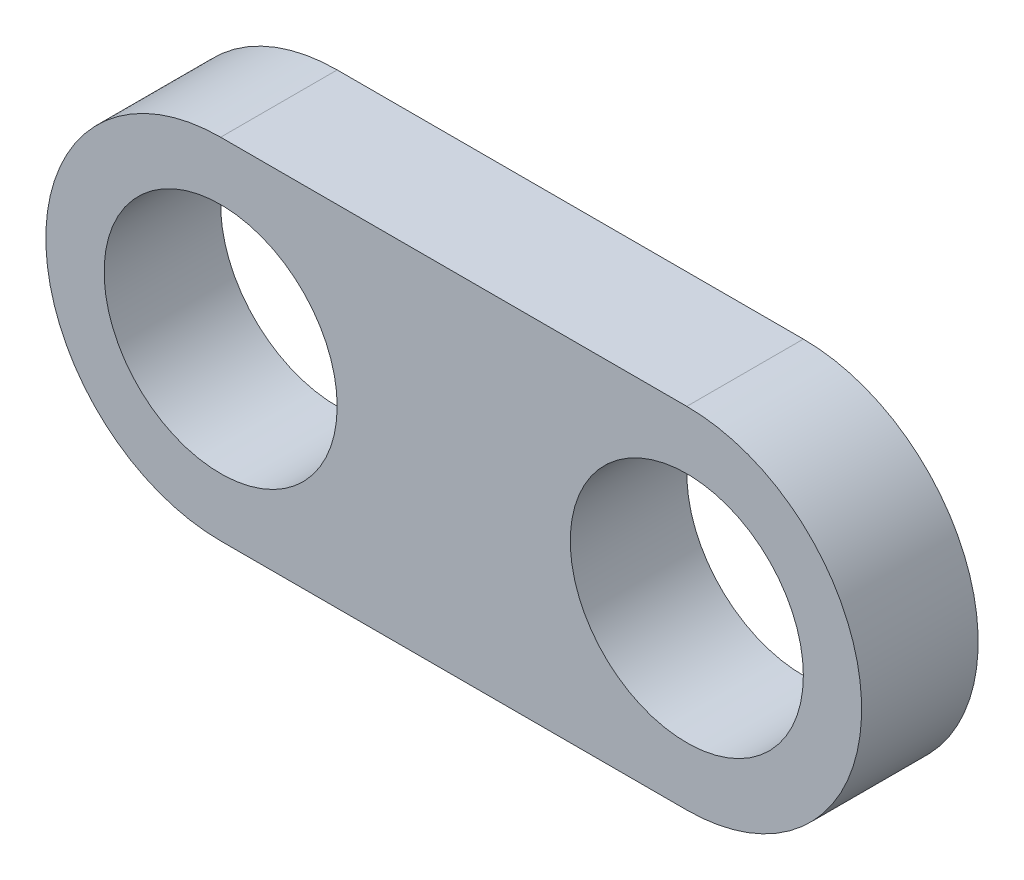
ISO-10303-21;
HEADER;
FILE_DESCRIPTION(('STEP AP214'),'2;1');
FILE_NAME('part.step','',(''),(''),'','','');
FILE_SCHEMA(('AUTOMOTIVE_DESIGN { 1 0 10303 214 1 1 1 1 }'));
ENDSEC;
DATA;
#1=APPLICATION_CONTEXT('core data for automotive mechanical design processes');
#2=APPLICATION_PROTOCOL_DEFINITION('international standard','automotive_design',2000,#1);
#3=PRODUCT_CONTEXT('',#1,'mechanical');
#4=PRODUCT('Part','Part','',(#3));
#5=PRODUCT_RELATED_PRODUCT_CATEGORY('part','',(#4));
#6=PRODUCT_DEFINITION_FORMATION('','',#4);
#7=PRODUCT_DEFINITION_CONTEXT('part definition',#1,'design');
#8=PRODUCT_DEFINITION('design','',#6,#7);
#9=PRODUCT_DEFINITION_SHAPE('','',#8);
#10=(LENGTH_UNIT() NAMED_UNIT(*) SI_UNIT(.MILLI.,.METRE.));
#11=(NAMED_UNIT(*) PLANE_ANGLE_UNIT() SI_UNIT($,.RADIAN.));
#12=(NAMED_UNIT(*) SI_UNIT($,.STERADIAN.) SOLID_ANGLE_UNIT());
#13=UNCERTAINTY_MEASURE_WITH_UNIT(LENGTH_MEASURE(1.E-05),#10,'distance_accuracy_value','');
#14=(GEOMETRIC_REPRESENTATION_CONTEXT(3) GLOBAL_UNCERTAINTY_ASSIGNED_CONTEXT((#13)) GLOBAL_UNIT_ASSIGNED_CONTEXT((#10,
#11,#12)) REPRESENTATION_CONTEXT('',''));
#15=CARTESIAN_POINT('',(0.,0.,0.));
#16=DIRECTION('',(0.,0.,1.));
#17=DIRECTION('',(1.,0.,0.));
#18=AXIS2_PLACEMENT_3D('',#15,#16,#17);
#19=CARTESIAN_POINT('',(0.,0.,10.));
#20=DIRECTION('',(0.,0.,1.));
#21=DIRECTION('',(1.,0.,0.));
#22=AXIS2_PLACEMENT_3D('',#19,#20,#21);
#23=PLANE('',#22);
#24=CARTESIAN_POINT('',(0.,0.,10.));
#25=DIRECTION('',(0.,0.,1.));
#26=DIRECTION('',(1.,0.,0.));
#27=AXIS2_PLACEMENT_3D('',#24,#25,#26);
#28=CIRCLE('',#27,10.);
#29=CARTESIAN_POINT('',(10.,0.,10.));
#30=VERTEX_POINT('',#29);
#31=EDGE_CURVE('E116',#30,#30,#28,.T.);
#32=ORIENTED_EDGE('',*,*,#31,.F.);
#33=EDGE_LOOP('',(#32));
#34=FACE_BOUND('',#33,.T.);
#35=CARTESIAN_POINT('',(0.,0.,10.));
#36=DIRECTION('',(0.,0.,1.));
#37=DIRECTION('',(1.,0.,0.));
#38=AXIS2_PLACEMENT_3D('',#35,#36,#37);
#39=CIRCLE('',#38,15.);
#40=CARTESIAN_POINT('',(0.,15.,10.));
#41=VERTEX_POINT('',#40);
#42=CARTESIAN_POINT('',(0.,-15.,10.));
#43=VERTEX_POINT('',#42);
#44=EDGE_CURVE('E96',#41,#43,#39,.T.);
#45=ORIENTED_EDGE('',*,*,#44,.T.);
#46=DIRECTION('',(1.,0.,0.));
#47=VECTOR('',#46,1.);
#48=CARTESIAN_POINT('',(40.,-15.,10.));
#49=LINE('',#48,#47);
#50=CARTESIAN_POINT('',(40.,-15.,10.));
#51=VERTEX_POINT('',#50);
#52=EDGE_CURVE('E91',#43,#51,#49,.T.);
#53=ORIENTED_EDGE('',*,*,#52,.T.);
#54=CARTESIAN_POINT('',(40.,0.,10.));
#55=DIRECTION('',(0.,0.,1.));
#56=DIRECTION('',(1.,0.,0.));
#57=AXIS2_PLACEMENT_3D('',#54,#55,#56);
#58=CIRCLE('',#57,15.);
#59=CARTESIAN_POINT('',(40.,15.,10.));
#60=VERTEX_POINT('',#59);
#61=EDGE_CURVE('E94',#51,#60,#58,.T.);
#62=ORIENTED_EDGE('',*,*,#61,.T.);
#63=DIRECTION('',(-1.,0.,0.));
#64=VECTOR('',#63,1.);
#65=CARTESIAN_POINT('',(0.,15.,10.));
#66=LINE('',#65,#64);
#67=EDGE_CURVE('E61',#60,#41,#66,.T.);
#68=ORIENTED_EDGE('',*,*,#67,.T.);
#69=EDGE_LOOP('',(#45,#53,#62,#68));
#70=FACE_BOUND('',#69,.T.);
#71=CARTESIAN_POINT('',(40.,0.,10.));
#72=DIRECTION('',(0.,0.,1.));
#73=DIRECTION('',(1.,0.,0.));
#74=AXIS2_PLACEMENT_3D('',#71,#72,#73);
#75=CIRCLE('',#74,9.99999999999999);
#76=CARTESIAN_POINT('',(50.,0.,10.));
#77=VERTEX_POINT('',#76);
#78=EDGE_CURVE('E138',#77,#77,#75,.T.);
#79=ORIENTED_EDGE('',*,*,#78,.F.);
#80=EDGE_LOOP('',(#79));
#81=FACE_BOUND('',#80,.T.);
#82=ADVANCED_FACE('F43',(#34,#70,#81),#23,.T.);
#83=CARTESIAN_POINT('',(0.,0.,0.));
#84=DIRECTION('',(0.,0.,1.));
#85=DIRECTION('',(1.,0.,0.));
#86=AXIS2_PLACEMENT_3D('',#83,#84,#85);
#87=PLANE('',#86);
#88=CARTESIAN_POINT('',(0.,0.,0.));
#89=DIRECTION('',(0.,0.,1.));
#90=DIRECTION('',(1.,0.,0.));
#91=AXIS2_PLACEMENT_3D('',#88,#89,#90);
#92=CIRCLE('',#91,15.);
#93=CARTESIAN_POINT('',(0.,15.,0.));
#94=VERTEX_POINT('',#93);
#95=CARTESIAN_POINT('',(0.,-15.,0.));
#96=VERTEX_POINT('',#95);
#97=EDGE_CURVE('E112',#94,#96,#92,.T.);
#98=ORIENTED_EDGE('',*,*,#97,.F.);
#99=DIRECTION('',(-1.,0.,0.));
#100=VECTOR('',#99,1.);
#101=CARTESIAN_POINT('',(0.,15.,0.));
#102=LINE('',#101,#100);
#103=CARTESIAN_POINT('',(40.,15.,0.));
#104=VERTEX_POINT('',#103);
#105=EDGE_CURVE('E84',#104,#94,#102,.T.);
#106=ORIENTED_EDGE('',*,*,#105,.F.);
#107=CARTESIAN_POINT('',(40.,0.,0.));
#108=DIRECTION('',(0.,0.,1.));
#109=DIRECTION('',(1.,0.,0.));
#110=AXIS2_PLACEMENT_3D('',#107,#108,#109);
#111=CIRCLE('',#110,15.);
#112=CARTESIAN_POINT('',(40.,-15.,0.));
#113=VERTEX_POINT('',#112);
#114=EDGE_CURVE('E78',#113,#104,#111,.T.);
#115=ORIENTED_EDGE('',*,*,#114,.F.);
#116=DIRECTION('',(1.,0.,0.));
#117=VECTOR('',#116,1.);
#118=CARTESIAN_POINT('',(40.,-15.,0.));
#119=LINE('',#118,#117);
#120=EDGE_CURVE('E101',#96,#113,#119,.T.);
#121=ORIENTED_EDGE('',*,*,#120,.F.);
#122=EDGE_LOOP('',(#98,#106,#115,#121));
#123=FACE_BOUND('',#122,.T.);
#124=CARTESIAN_POINT('',(0.,0.,0.));
#125=DIRECTION('',(0.,0.,1.));
#126=DIRECTION('',(1.,0.,0.));
#127=AXIS2_PLACEMENT_3D('',#124,#125,#126);
#128=CIRCLE('',#127,10.);
#129=CARTESIAN_POINT('',(10.,0.,0.));
#130=VERTEX_POINT('',#129);
#131=EDGE_CURVE('E134',#130,#130,#128,.T.);
#132=ORIENTED_EDGE('',*,*,#131,.T.);
#133=EDGE_LOOP('',(#132));
#134=FACE_BOUND('',#133,.T.);
#135=CARTESIAN_POINT('',(40.,0.,0.));
#136=DIRECTION('',(0.,0.,1.));
#137=DIRECTION('',(1.,0.,0.));
#138=AXIS2_PLACEMENT_3D('',#135,#136,#137);
#139=CIRCLE('',#138,9.99999999999999);
#140=CARTESIAN_POINT('',(50.,0.,0.));
#141=VERTEX_POINT('',#140);
#142=EDGE_CURVE('E142',#141,#141,#139,.T.);
#143=ORIENTED_EDGE('',*,*,#142,.T.);
#144=EDGE_LOOP('',(#143));
#145=FACE_BOUND('',#144,.T.);
#146=ADVANCED_FACE('F129',(#123,#134,#145),#87,.F.);
#147=CARTESIAN_POINT('',(0.,0.,10.));
#148=DIRECTION('',(0.,0.,-1.));
#149=DIRECTION('',(-1.,0.,0.));
#150=AXIS2_PLACEMENT_3D('',#147,#148,#149);
#151=CYLINDRICAL_SURFACE('',#150,15.);
#152=ORIENTED_EDGE('',*,*,#97,.T.);
#153=DIRECTION('',(0.,0.,-1.));
#154=VECTOR('',#153,1.);
#155=CARTESIAN_POINT('',(0.,-15.,10.));
#156=LINE('',#155,#154);
#157=EDGE_CURVE('E11',#43,#96,#156,.T.);
#158=ORIENTED_EDGE('',*,*,#157,.F.);
#159=ORIENTED_EDGE('',*,*,#44,.F.);
#160=DIRECTION('',(0.,0.,-1.));
#161=VECTOR('',#160,1.);
#162=CARTESIAN_POINT('',(0.,15.,10.));
#163=LINE('',#162,#161);
#164=EDGE_CURVE('E108',#41,#94,#163,.T.);
#165=ORIENTED_EDGE('',*,*,#164,.T.);
#166=EDGE_LOOP('',(#152,#158,#159,#165));
#167=FACE_BOUND('',#166,.T.);
#168=ADVANCED_FACE('F45',(#167),#151,.T.);
#169=CARTESIAN_POINT('',(40.,-15.,10.));
#170=DIRECTION('',(0.,1.,0.));
#171=DIRECTION('',(0.,0.,1.));
#172=AXIS2_PLACEMENT_3D('',#169,#170,#171);
#173=PLANE('',#172);
#174=ORIENTED_EDGE('',*,*,#120,.T.);
#175=DIRECTION('',(0.,0.,-1.));
#176=VECTOR('',#175,1.);
#177=CARTESIAN_POINT('',(40.,-15.,10.));
#178=LINE('',#177,#176);
#179=EDGE_CURVE('E53',#51,#113,#178,.T.);
#180=ORIENTED_EDGE('',*,*,#179,.F.);
#181=ORIENTED_EDGE('',*,*,#52,.F.);
#182=ORIENTED_EDGE('',*,*,#157,.T.);
#183=EDGE_LOOP('',(#174,#180,#181,#182));
#184=FACE_BOUND('',#183,.T.);
#185=ADVANCED_FACE('F100',(#184),#173,.F.);
#186=CARTESIAN_POINT('',(40.,0.,10.));
#187=DIRECTION('',(0.,0.,-1.));
#188=DIRECTION('',(-1.,0.,0.));
#189=AXIS2_PLACEMENT_3D('',#186,#187,#188);
#190=CYLINDRICAL_SURFACE('',#189,15.);
#191=ORIENTED_EDGE('',*,*,#114,.T.);
#192=DIRECTION('',(0.,0.,-1.));
#193=VECTOR('',#192,1.);
#194=CARTESIAN_POINT('',(40.,15.,10.));
#195=LINE('',#194,#193);
#196=EDGE_CURVE('E103',#60,#104,#195,.T.);
#197=ORIENTED_EDGE('',*,*,#196,.F.);
#198=ORIENTED_EDGE('',*,*,#61,.F.);
#199=ORIENTED_EDGE('',*,*,#179,.T.);
#200=EDGE_LOOP('',(#191,#197,#198,#199));
#201=FACE_BOUND('',#200,.T.);
#202=ADVANCED_FACE('F104',(#201),#190,.T.);
#203=CARTESIAN_POINT('',(0.,15.,10.));
#204=DIRECTION('',(0.,-1.,0.));
#205=DIRECTION('',(0.,0.,-1.));
#206=AXIS2_PLACEMENT_3D('',#203,#204,#205);
#207=PLANE('',#206);
#208=ORIENTED_EDGE('',*,*,#105,.T.);
#209=ORIENTED_EDGE('',*,*,#164,.F.);
#210=ORIENTED_EDGE('',*,*,#67,.F.);
#211=ORIENTED_EDGE('',*,*,#196,.T.);
#212=EDGE_LOOP('',(#208,#209,#210,#211));
#213=FACE_BOUND('',#212,.T.);
#214=ADVANCED_FACE('F126',(#213),#207,.F.);
#215=CARTESIAN_POINT('',(0.,0.,10.));
#216=DIRECTION('',(0.,0.,-1.));
#217=DIRECTION('',(-1.,0.,0.));
#218=AXIS2_PLACEMENT_3D('',#215,#216,#217);
#219=CYLINDRICAL_SURFACE('',#218,10.);
#220=ORIENTED_EDGE('',*,*,#31,.T.);
#221=EDGE_LOOP('',(#220));
#222=FACE_BOUND('',#221,.T.);
#223=ORIENTED_EDGE('',*,*,#131,.F.);
#224=EDGE_LOOP('',(#223));
#225=FACE_BOUND('',#224,.T.);
#226=ADVANCED_FACE('F161',(#222,#225),#219,.F.);
#227=CARTESIAN_POINT('',(40.,0.,10.));
#228=DIRECTION('',(0.,0.,-1.));
#229=DIRECTION('',(-1.,0.,0.));
#230=AXIS2_PLACEMENT_3D('',#227,#228,#229);
#231=CYLINDRICAL_SURFACE('',#230,9.99999999999999);
#232=ORIENTED_EDGE('',*,*,#78,.T.);
#233=EDGE_LOOP('',(#232));
#234=FACE_BOUND('',#233,.T.);
#235=ORIENTED_EDGE('',*,*,#142,.F.);
#236=EDGE_LOOP('',(#235));
#237=FACE_BOUND('',#236,.T.);
#238=ADVANCED_FACE('F150',(#234,#237),#231,.F.);
#239=CLOSED_SHELL('',(#82,#146,#168,#185,#202,#214,#226,#238));
#240=MANIFOLD_SOLID_BREP('B2',#239);
#241=ADVANCED_BREP_SHAPE_REPRESENTATION('',(#18,#240),#14);
#242=SHAPE_DEFINITION_REPRESENTATION(#9,#241);
ENDSEC;
END-ISO-10303-21;
